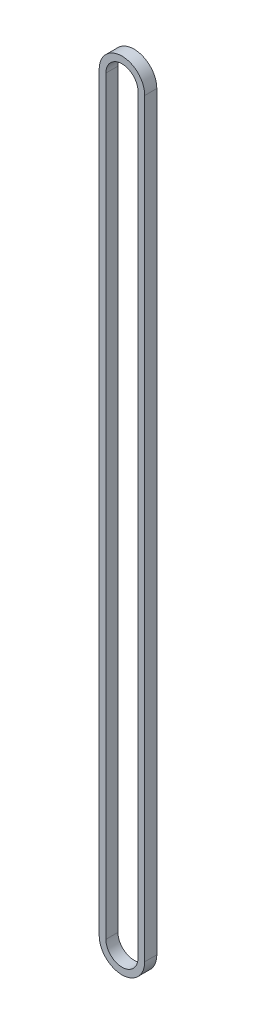
ISO-10303-21;
HEADER;
FILE_DESCRIPTION(('STEP AP214'),'2;1');
FILE_NAME('part.step','',(''),(''),'','','');
FILE_SCHEMA(('AUTOMOTIVE_DESIGN { 1 0 10303 214 1 1 1 1 }'));
ENDSEC;
DATA;
#1=APPLICATION_CONTEXT('core data for automotive mechanical design processes');
#2=APPLICATION_PROTOCOL_DEFINITION('international standard','automotive_design',2000,#1);
#3=PRODUCT_CONTEXT('',#1,'mechanical');
#4=PRODUCT('Part','Part','',(#3));
#5=PRODUCT_RELATED_PRODUCT_CATEGORY('part','',(#4));
#6=PRODUCT_DEFINITION_FORMATION('','',#4);
#7=PRODUCT_DEFINITION_CONTEXT('part definition',#1,'design');
#8=PRODUCT_DEFINITION('design','',#6,#7);
#9=PRODUCT_DEFINITION_SHAPE('','',#8);
#10=(LENGTH_UNIT() NAMED_UNIT(*) SI_UNIT(.MILLI.,.METRE.));
#11=(NAMED_UNIT(*) PLANE_ANGLE_UNIT() SI_UNIT($,.RADIAN.));
#12=(NAMED_UNIT(*) SI_UNIT($,.STERADIAN.) SOLID_ANGLE_UNIT());
#13=UNCERTAINTY_MEASURE_WITH_UNIT(LENGTH_MEASURE(1.E-05),#10,'distance_accuracy_value','');
#14=(GEOMETRIC_REPRESENTATION_CONTEXT(3) GLOBAL_UNCERTAINTY_ASSIGNED_CONTEXT((#13)) GLOBAL_UNIT_ASSIGNED_CONTEXT((#10,
#11,#12)) REPRESENTATION_CONTEXT('',''));
#15=CARTESIAN_POINT('',(0.,0.,0.));
#16=DIRECTION('',(0.,0.,1.));
#17=DIRECTION('',(1.,0.,0.));
#18=AXIS2_PLACEMENT_3D('',#15,#16,#17);
#19=CARTESIAN_POINT('',(0.,-140.,4.5));
#20=DIRECTION('',(0.,0.,1.));
#21=DIRECTION('',(1.,0.,0.));
#22=AXIS2_PLACEMENT_3D('',#19,#20,#21);
#23=PLANE('',#22);
#24=CARTESIAN_POINT('',(0.,-140.,4.5));
#25=DIRECTION('',(0.,0.,1.));
#26=DIRECTION('',(1.,0.,0.));
#27=AXIS2_PLACEMENT_3D('',#24,#25,#26);
#28=CIRCLE('',#27,8.5);
#29=CARTESIAN_POINT('',(-8.5,-140.,4.5));
#30=VERTEX_POINT('',#29);
#31=CARTESIAN_POINT('',(8.5,-140.,4.5));
#32=VERTEX_POINT('',#31);
#33=EDGE_CURVE('E136',#30,#32,#28,.T.);
#34=ORIENTED_EDGE('',*,*,#33,.T.);
#35=DIRECTION('',(0.,1.,0.));
#36=VECTOR('',#35,1.);
#37=CARTESIAN_POINT('',(8.5,-140.,4.5));
#38=LINE('',#37,#36);
#39=CARTESIAN_POINT('',(8.49999999999995,140.,4.5));
#40=VERTEX_POINT('',#39);
#41=EDGE_CURVE('E139',#32,#40,#38,.T.);
#42=ORIENTED_EDGE('',*,*,#41,.T.);
#43=CARTESIAN_POINT('',(0.,140.,4.5));
#44=DIRECTION('',(0.,0.,1.));
#45=DIRECTION('',(1.,0.,0.));
#46=AXIS2_PLACEMENT_3D('',#43,#44,#45);
#47=CIRCLE('',#46,8.5);
#48=CARTESIAN_POINT('',(-8.5,140.,4.5));
#49=VERTEX_POINT('',#48);
#50=EDGE_CURVE('E142',#40,#49,#47,.T.);
#51=ORIENTED_EDGE('',*,*,#50,.T.);
#52=DIRECTION('',(0.,-1.,0.));
#53=VECTOR('',#52,1.);
#54=CARTESIAN_POINT('',(-8.5,-140.,4.5));
#55=LINE('',#54,#53);
#56=EDGE_CURVE('E144',#49,#30,#55,.T.);
#57=ORIENTED_EDGE('',*,*,#56,.T.);
#58=EDGE_LOOP('',(#34,#42,#51,#57));
#59=FACE_BOUND('',#58,.T.);
#60=DIRECTION('',(0.,1.,0.));
#61=VECTOR('',#60,1.);
#62=CARTESIAN_POINT('',(6.,-140.,4.5));
#63=LINE('',#62,#61);
#64=CARTESIAN_POINT('',(6.,-140.,4.5));
#65=VERTEX_POINT('',#64);
#66=CARTESIAN_POINT('',(5.99999999999995,140.,4.5));
#67=VERTEX_POINT('',#66);
#68=EDGE_CURVE('E108',#65,#67,#63,.T.);
#69=ORIENTED_EDGE('',*,*,#68,.F.);
#70=CARTESIAN_POINT('',(0.,-140.,4.5));
#71=DIRECTION('',(0.,0.,1.));
#72=DIRECTION('',(1.,0.,0.));
#73=AXIS2_PLACEMENT_3D('',#70,#71,#72);
#74=CIRCLE('',#73,6.);
#75=CARTESIAN_POINT('',(-6.,-140.,4.5));
#76=VERTEX_POINT('',#75);
#77=EDGE_CURVE('E100',#76,#65,#74,.T.);
#78=ORIENTED_EDGE('',*,*,#77,.F.);
#79=DIRECTION('',(0.,-1.,0.));
#80=VECTOR('',#79,1.);
#81=CARTESIAN_POINT('',(-6.,-140.,4.5));
#82=LINE('',#81,#80);
#83=CARTESIAN_POINT('',(-6.,140.,4.5));
#84=VERTEX_POINT('',#83);
#85=EDGE_CURVE('E122',#84,#76,#82,.T.);
#86=ORIENTED_EDGE('',*,*,#85,.F.);
#87=CARTESIAN_POINT('',(0.,140.,4.5));
#88=DIRECTION('',(0.,0.,1.));
#89=DIRECTION('',(1.,0.,0.));
#90=AXIS2_PLACEMENT_3D('',#87,#88,#89);
#91=CIRCLE('',#90,6.);
#92=EDGE_CURVE('E120',#67,#84,#91,.T.);
#93=ORIENTED_EDGE('',*,*,#92,.F.);
#94=EDGE_LOOP('',(#69,#78,#86,#93));
#95=FACE_BOUND('',#94,.T.);
#96=ADVANCED_FACE('F35',(#59,#95),#23,.T.);
#97=CARTESIAN_POINT('',(0.,-140.,0.));
#98=DIRECTION('',(0.,0.,1.));
#99=DIRECTION('',(1.,0.,0.));
#100=AXIS2_PLACEMENT_3D('',#97,#98,#99);
#101=PLANE('',#100);
#102=CARTESIAN_POINT('',(0.,-140.,0.));
#103=DIRECTION('',(0.,0.,1.));
#104=DIRECTION('',(1.,0.,0.));
#105=AXIS2_PLACEMENT_3D('',#102,#103,#104);
#106=CIRCLE('',#105,8.5);
#107=CARTESIAN_POINT('',(-8.5,-140.,0.));
#108=VERTEX_POINT('',#107);
#109=CARTESIAN_POINT('',(8.5,-140.,0.));
#110=VERTEX_POINT('',#109);
#111=EDGE_CURVE('E116',#108,#110,#106,.T.);
#112=ORIENTED_EDGE('',*,*,#111,.F.);
#113=DIRECTION('',(0.,-1.,0.));
#114=VECTOR('',#113,1.);
#115=CARTESIAN_POINT('',(-8.5,-140.,0.));
#116=LINE('',#115,#114);
#117=CARTESIAN_POINT('',(-8.5,140.,0.));
#118=VERTEX_POINT('',#117);
#119=EDGE_CURVE('E140',#118,#108,#116,.T.);
#120=ORIENTED_EDGE('',*,*,#119,.F.);
#121=CARTESIAN_POINT('',(0.,140.,0.));
#122=DIRECTION('',(0.,0.,1.));
#123=DIRECTION('',(1.,0.,0.));
#124=AXIS2_PLACEMENT_3D('',#121,#122,#123);
#125=CIRCLE('',#124,8.5);
#126=CARTESIAN_POINT('',(8.49999999999995,140.,0.));
#127=VERTEX_POINT('',#126);
#128=EDGE_CURVE('E151',#127,#118,#125,.T.);
#129=ORIENTED_EDGE('',*,*,#128,.F.);
#130=DIRECTION('',(0.,1.,0.));
#131=VECTOR('',#130,1.);
#132=CARTESIAN_POINT('',(8.5,-140.,0.));
#133=LINE('',#132,#131);
#134=EDGE_CURVE('E149',#110,#127,#133,.T.);
#135=ORIENTED_EDGE('',*,*,#134,.F.);
#136=EDGE_LOOP('',(#112,#120,#129,#135));
#137=FACE_BOUND('',#136,.T.);
#138=CARTESIAN_POINT('',(0.,-140.,0.));
#139=DIRECTION('',(0.,0.,1.));
#140=DIRECTION('',(1.,0.,0.));
#141=AXIS2_PLACEMENT_3D('',#138,#139,#140);
#142=CIRCLE('',#141,6.);
#143=CARTESIAN_POINT('',(-6.,-140.,0.));
#144=VERTEX_POINT('',#143);
#145=CARTESIAN_POINT('',(6.,-140.,0.));
#146=VERTEX_POINT('',#145);
#147=EDGE_CURVE('E58',#144,#146,#142,.T.);
#148=ORIENTED_EDGE('',*,*,#147,.T.);
#149=DIRECTION('',(0.,1.,0.));
#150=VECTOR('',#149,1.);
#151=CARTESIAN_POINT('',(6.,-140.,0.));
#152=LINE('',#151,#150);
#153=CARTESIAN_POINT('',(5.99999999999995,140.,0.));
#154=VERTEX_POINT('',#153);
#155=EDGE_CURVE('E115',#146,#154,#152,.T.);
#156=ORIENTED_EDGE('',*,*,#155,.T.);
#157=CARTESIAN_POINT('',(0.,140.,0.));
#158=DIRECTION('',(0.,0.,1.));
#159=DIRECTION('',(1.,0.,0.));
#160=AXIS2_PLACEMENT_3D('',#157,#158,#159);
#161=CIRCLE('',#160,6.);
#162=CARTESIAN_POINT('',(-6.,140.,0.));
#163=VERTEX_POINT('',#162);
#164=EDGE_CURVE('E128',#154,#163,#161,.T.);
#165=ORIENTED_EDGE('',*,*,#164,.T.);
#166=DIRECTION('',(0.,-1.,0.));
#167=VECTOR('',#166,1.);
#168=CARTESIAN_POINT('',(-6.,-140.,0.));
#169=LINE('',#168,#167);
#170=EDGE_CURVE('E109',#163,#144,#169,.T.);
#171=ORIENTED_EDGE('',*,*,#170,.T.);
#172=EDGE_LOOP('',(#148,#156,#165,#171));
#173=FACE_BOUND('',#172,.T.);
#174=ADVANCED_FACE('F169',(#137,#173),#101,.F.);
#175=CARTESIAN_POINT('',(0.,-140.,4.5));
#176=DIRECTION('',(0.,0.,-1.));
#177=DIRECTION('',(-1.,0.,0.));
#178=AXIS2_PLACEMENT_3D('',#175,#176,#177);
#179=CYLINDRICAL_SURFACE('',#178,8.5);
#180=ORIENTED_EDGE('',*,*,#111,.T.);
#181=DIRECTION('',(0.,0.,-1.));
#182=VECTOR('',#181,1.);
#183=CARTESIAN_POINT('',(8.5,-140.,4.5));
#184=LINE('',#183,#182);
#185=EDGE_CURVE('E11',#32,#110,#184,.T.);
#186=ORIENTED_EDGE('',*,*,#185,.F.);
#187=ORIENTED_EDGE('',*,*,#33,.F.);
#188=DIRECTION('',(0.,0.,-1.));
#189=VECTOR('',#188,1.);
#190=CARTESIAN_POINT('',(-8.5,-140.,4.5));
#191=LINE('',#190,#189);
#192=EDGE_CURVE('E146',#30,#108,#191,.T.);
#193=ORIENTED_EDGE('',*,*,#192,.T.);
#194=EDGE_LOOP('',(#180,#186,#187,#193));
#195=FACE_BOUND('',#194,.T.);
#196=ADVANCED_FACE('F37',(#195),#179,.T.);
#197=CARTESIAN_POINT('',(8.5,-140.,4.5));
#198=DIRECTION('',(-1.,0.,0.));
#199=DIRECTION('',(0.,0.,1.));
#200=AXIS2_PLACEMENT_3D('',#197,#198,#199);
#201=PLANE('',#200);
#202=ORIENTED_EDGE('',*,*,#134,.T.);
#203=DIRECTION('',(0.,0.,-1.));
#204=VECTOR('',#203,1.);
#205=CARTESIAN_POINT('',(8.49999999999995,140.,4.5));
#206=LINE('',#205,#204);
#207=EDGE_CURVE('E43',#40,#127,#206,.T.);
#208=ORIENTED_EDGE('',*,*,#207,.F.);
#209=ORIENTED_EDGE('',*,*,#41,.F.);
#210=ORIENTED_EDGE('',*,*,#185,.T.);
#211=EDGE_LOOP('',(#202,#208,#209,#210));
#212=FACE_BOUND('',#211,.T.);
#213=ADVANCED_FACE('F179',(#212),#201,.F.);
#214=CARTESIAN_POINT('',(0.,140.,4.5));
#215=DIRECTION('',(0.,0.,-1.));
#216=DIRECTION('',(-1.,0.,0.));
#217=AXIS2_PLACEMENT_3D('',#214,#215,#216);
#218=CYLINDRICAL_SURFACE('',#217,8.5);
#219=ORIENTED_EDGE('',*,*,#128,.T.);
#220=DIRECTION('',(0.,0.,-1.));
#221=VECTOR('',#220,1.);
#222=CARTESIAN_POINT('',(-8.5,140.,4.5));
#223=LINE('',#222,#221);
#224=EDGE_CURVE('E156',#49,#118,#223,.T.);
#225=ORIENTED_EDGE('',*,*,#224,.F.);
#226=ORIENTED_EDGE('',*,*,#50,.F.);
#227=ORIENTED_EDGE('',*,*,#207,.T.);
#228=EDGE_LOOP('',(#219,#225,#226,#227));
#229=FACE_BOUND('',#228,.T.);
#230=ADVANCED_FACE('F163',(#229),#218,.T.);
#231=CARTESIAN_POINT('',(-8.5,-140.,4.5));
#232=DIRECTION('',(1.,0.,0.));
#233=DIRECTION('',(0.,0.,-1.));
#234=AXIS2_PLACEMENT_3D('',#231,#232,#233);
#235=PLANE('',#234);
#236=ORIENTED_EDGE('',*,*,#119,.T.);
#237=ORIENTED_EDGE('',*,*,#192,.F.);
#238=ORIENTED_EDGE('',*,*,#56,.F.);
#239=ORIENTED_EDGE('',*,*,#224,.T.);
#240=EDGE_LOOP('',(#236,#237,#238,#239));
#241=FACE_BOUND('',#240,.T.);
#242=ADVANCED_FACE('F173',(#241),#235,.F.);
#243=CARTESIAN_POINT('',(0.,-140.,4.5));
#244=DIRECTION('',(0.,0.,-1.));
#245=DIRECTION('',(-1.,0.,0.));
#246=AXIS2_PLACEMENT_3D('',#243,#244,#245);
#247=CYLINDRICAL_SURFACE('',#246,6.);
#248=ORIENTED_EDGE('',*,*,#147,.F.);
#249=DIRECTION('',(0.,0.,-1.));
#250=VECTOR('',#249,1.);
#251=CARTESIAN_POINT('',(-6.,-140.,4.5));
#252=LINE('',#251,#250);
#253=EDGE_CURVE('E104',#76,#144,#252,.T.);
#254=ORIENTED_EDGE('',*,*,#253,.F.);
#255=ORIENTED_EDGE('',*,*,#77,.T.);
#256=DIRECTION('',(0.,0.,-1.));
#257=VECTOR('',#256,1.);
#258=CARTESIAN_POINT('',(6.,-140.,4.5));
#259=LINE('',#258,#257);
#260=EDGE_CURVE('E103',#65,#146,#259,.T.);
#261=ORIENTED_EDGE('',*,*,#260,.T.);
#262=EDGE_LOOP('',(#248,#254,#255,#261));
#263=FACE_BOUND('',#262,.T.);
#264=ADVANCED_FACE('F102',(#263),#247,.F.);
#265=CARTESIAN_POINT('',(6.,-140.,4.5));
#266=DIRECTION('',(-1.,0.,0.));
#267=DIRECTION('',(0.,0.,1.));
#268=AXIS2_PLACEMENT_3D('',#265,#266,#267);
#269=PLANE('',#268);
#270=ORIENTED_EDGE('',*,*,#155,.F.);
#271=ORIENTED_EDGE('',*,*,#260,.F.);
#272=ORIENTED_EDGE('',*,*,#68,.T.);
#273=DIRECTION('',(0.,0.,-1.));
#274=VECTOR('',#273,1.);
#275=CARTESIAN_POINT('',(5.99999999999995,140.,4.5));
#276=LINE('',#275,#274);
#277=EDGE_CURVE('E117',#67,#154,#276,.T.);
#278=ORIENTED_EDGE('',*,*,#277,.T.);
#279=EDGE_LOOP('',(#270,#271,#272,#278));
#280=FACE_BOUND('',#279,.T.);
#281=ADVANCED_FACE('F112',(#280),#269,.T.);
#282=CARTESIAN_POINT('',(0.,140.,4.5));
#283=DIRECTION('',(0.,0.,-1.));
#284=DIRECTION('',(-1.,0.,0.));
#285=AXIS2_PLACEMENT_3D('',#282,#283,#284);
#286=CYLINDRICAL_SURFACE('',#285,6.);
#287=ORIENTED_EDGE('',*,*,#164,.F.);
#288=ORIENTED_EDGE('',*,*,#277,.F.);
#289=ORIENTED_EDGE('',*,*,#92,.T.);
#290=DIRECTION('',(0.,0.,-1.));
#291=VECTOR('',#290,1.);
#292=CARTESIAN_POINT('',(-6.,140.,4.5));
#293=LINE('',#292,#291);
#294=EDGE_CURVE('E50',#84,#163,#293,.T.);
#295=ORIENTED_EDGE('',*,*,#294,.T.);
#296=EDGE_LOOP('',(#287,#288,#289,#295));
#297=FACE_BOUND('',#296,.T.);
#298=ADVANCED_FACE('F202',(#297),#286,.F.);
#299=CARTESIAN_POINT('',(-6.,-140.,4.5));
#300=DIRECTION('',(1.,0.,0.));
#301=DIRECTION('',(0.,0.,-1.));
#302=AXIS2_PLACEMENT_3D('',#299,#300,#301);
#303=PLANE('',#302);
#304=ORIENTED_EDGE('',*,*,#170,.F.);
#305=ORIENTED_EDGE('',*,*,#294,.F.);
#306=ORIENTED_EDGE('',*,*,#85,.T.);
#307=ORIENTED_EDGE('',*,*,#253,.T.);
#308=EDGE_LOOP('',(#304,#305,#306,#307));
#309=FACE_BOUND('',#308,.T.);
#310=ADVANCED_FACE('F206',(#309),#303,.T.);
#311=CLOSED_SHELL('',(#96,#174,#196,#213,#230,#242,#264,#281,#298,#310));
#312=MANIFOLD_SOLID_BREP('B2',#311);
#313=ADVANCED_BREP_SHAPE_REPRESENTATION('',(#18,#312),#14);
#314=SHAPE_DEFINITION_REPRESENTATION(#9,#313);
ENDSEC;
END-ISO-10303-21;
